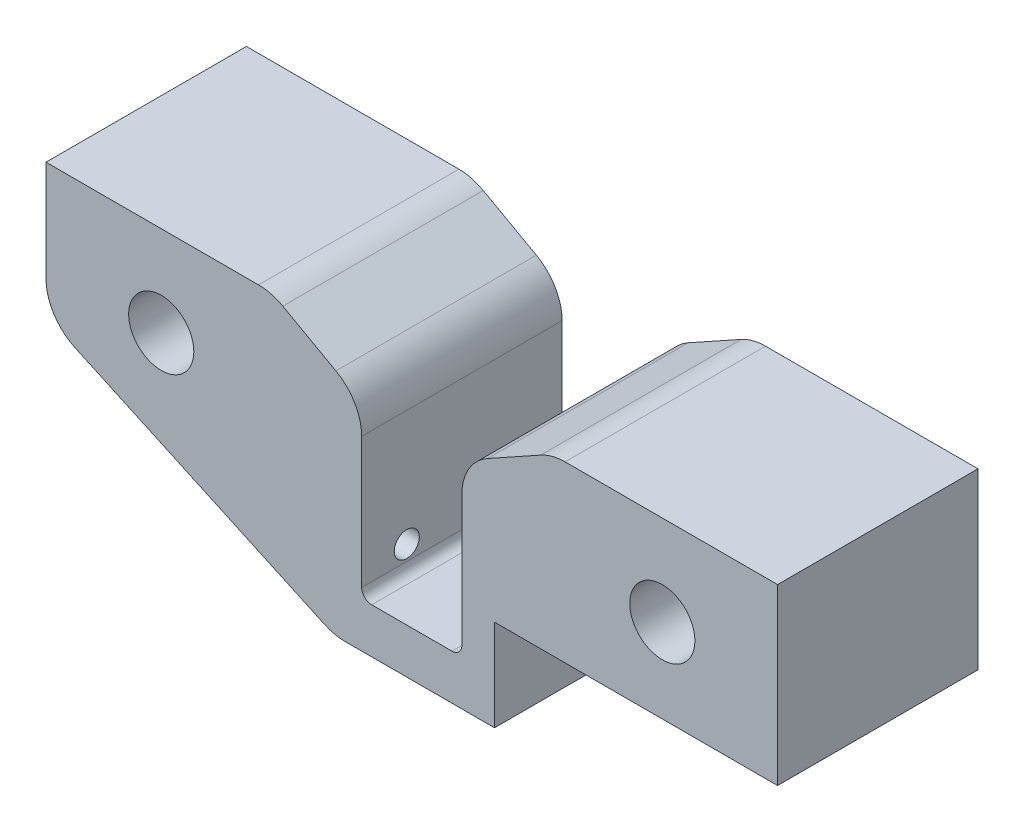
ISO-10303-21;
HEADER;
FILE_DESCRIPTION(('STEP AP214'),'2;1');
FILE_NAME('part.step','',(''),(''),'','','');
FILE_SCHEMA(('AUTOMOTIVE_DESIGN { 1 0 10303 214 1 1 1 1 }'));
ENDSEC;
DATA;
#1=APPLICATION_CONTEXT('core data for automotive mechanical design processes');
#2=APPLICATION_PROTOCOL_DEFINITION('international standard','automotive_design',2000,#1);
#3=PRODUCT_CONTEXT('',#1,'mechanical');
#4=PRODUCT('Part','Part','',(#3));
#5=PRODUCT_RELATED_PRODUCT_CATEGORY('part','',(#4));
#6=PRODUCT_DEFINITION_FORMATION('','',#4);
#7=PRODUCT_DEFINITION_CONTEXT('part definition',#1,'design');
#8=PRODUCT_DEFINITION('design','',#6,#7);
#9=PRODUCT_DEFINITION_SHAPE('','',#8);
#10=(LENGTH_UNIT() NAMED_UNIT(*) SI_UNIT(.MILLI.,.METRE.));
#11=(NAMED_UNIT(*) PLANE_ANGLE_UNIT() SI_UNIT($,.RADIAN.));
#12=(NAMED_UNIT(*) SI_UNIT($,.STERADIAN.) SOLID_ANGLE_UNIT());
#13=UNCERTAINTY_MEASURE_WITH_UNIT(LENGTH_MEASURE(1.E-05),#10,'distance_accuracy_value','');
#14=(GEOMETRIC_REPRESENTATION_CONTEXT(3) GLOBAL_UNCERTAINTY_ASSIGNED_CONTEXT((#13)) GLOBAL_UNIT_ASSIGNED_CONTEXT((#10,
#11,#12)) REPRESENTATION_CONTEXT('',''));
#15=CARTESIAN_POINT('',(0.,0.,0.));
#16=DIRECTION('',(0.,0.,1.));
#17=DIRECTION('',(1.,0.,0.));
#18=AXIS2_PLACEMENT_3D('',#15,#16,#17);
#19=CARTESIAN_POINT('',(0.,0.,25.4));
#20=DIRECTION('',(0.,0.,1.));
#21=DIRECTION('',(1.,0.,0.));
#22=AXIS2_PLACEMENT_3D('',#19,#20,#21);
#23=PLANE('',#22);
#24=DIRECTION('',(0.908325815942853,-0.418263328648053,0.));
#25=VECTOR('',#24,1.);
#26=CARTESIAN_POINT('',(-9.81138830642081,0.,25.4));
#27=LINE('',#26,#25);
#28=CARTESIAN_POINT('',(-42.6609721369151,15.1264843919291,25.4));
#29=VERTEX_POINT('',#28);
#30=CARTESIAN_POINT('',(-11.0755791685001,0.582131068762884,25.4));
#31=VERTEX_POINT('',#30);
#32=EDGE_CURVE('E268',#29,#31,#27,.T.);
#33=ORIENTED_EDGE('',*,*,#32,.T.);
#34=CARTESIAN_POINT('',(-8.41960703158495,6.35,25.4));
#35=DIRECTION('',(0.,0.,1.));
#36=DIRECTION('',(1.,0.,0.));
#37=AXIS2_PLACEMENT_3D('',#34,#35,#36);
#38=CIRCLE('',#37,6.35);
#39=CARTESIAN_POINT('',(-8.41960703158497,0.,25.4));
#40=VERTEX_POINT('',#39);
#41=EDGE_CURVE('E45',#31,#40,#38,.T.);
#42=ORIENTED_EDGE('',*,*,#41,.T.);
#43=DIRECTION('',(1.,0.,0.));
#44=VECTOR('',#43,1.);
#45=CARTESIAN_POINT('',(-46.355,0.,25.4));
#46=LINE('',#45,#44);
#47=CARTESIAN_POINT('',(10.4825314737521,0.,25.4));
#48=VERTEX_POINT('',#47);
#49=EDGE_CURVE('E182',#40,#48,#46,.T.);
#50=ORIENTED_EDGE('',*,*,#49,.T.);
#51=DIRECTION('',(0.,1.,0.));
#52=VECTOR('',#51,1.);
#53=CARTESIAN_POINT('',(10.4825314737521,0.,25.4));
#54=LINE('',#53,#52);
#55=CARTESIAN_POINT('',(10.4825314737521,11.5964157249992,25.4));
#56=VERTEX_POINT('',#55);
#57=EDGE_CURVE('E186',#48,#56,#54,.T.);
#58=ORIENTED_EDGE('',*,*,#57,.T.);
#59=DIRECTION('',(1.,0.,0.));
#60=VECTOR('',#59,1.);
#61=CARTESIAN_POINT('',(10.4825314737521,11.5964157249992,25.4));
#62=LINE('',#61,#60);
#63=CARTESIAN_POINT('',(46.355,11.5964157249992,25.4));
#64=VERTEX_POINT('',#63);
#65=EDGE_CURVE('E203',#56,#64,#62,.T.);
#66=ORIENTED_EDGE('',*,*,#65,.T.);
#67=DIRECTION('',(0.,1.,0.));
#68=VECTOR('',#67,1.);
#69=CARTESIAN_POINT('',(46.355,0.,25.4));
#70=LINE('',#69,#68);
#71=CARTESIAN_POINT('',(46.355,33.655,25.4));
#72=VERTEX_POINT('',#71);
#73=EDGE_CURVE('E192',#64,#72,#70,.T.);
#74=ORIENTED_EDGE('',*,*,#73,.T.);
#75=DIRECTION('',(-1.,0.,0.));
#76=VECTOR('',#75,1.);
#77=CARTESIAN_POINT('',(46.355,33.655,25.4));
#78=LINE('',#77,#76);
#79=CARTESIAN_POINT('',(19.4254502790535,33.655,25.4));
#80=VERTEX_POINT('',#79);
#81=EDGE_CURVE('E236',#72,#80,#78,.T.);
#82=ORIENTED_EDGE('',*,*,#81,.T.);
#83=CARTESIAN_POINT('',(19.4254502790535,27.305,25.4));
#84=DIRECTION('',(0.,0.,1.));
#85=DIRECTION('',(1.,0.,0.));
#86=AXIS2_PLACEMENT_3D('',#83,#84,#85);
#87=CIRCLE('',#86,6.35);
#88=CARTESIAN_POINT('',(16.3416176660692,32.8558987033718,25.4));
#89=VERTEX_POINT('',#88);
#90=EDGE_CURVE('E378',#80,#89,#87,.T.);
#91=ORIENTED_EDGE('',*,*,#90,.T.);
#92=DIRECTION('',(-0.874157276121537,-0.485642931178633,0.));
#93=VECTOR('',#92,1.);
#94=CARTESIAN_POINT('',(17.78,33.655,25.4));
#95=LINE('',#94,#93);
#96=CARTESIAN_POINT('',(9.61616738701568,29.1195374372309,25.4));
#97=VERTEX_POINT('',#96);
#98=EDGE_CURVE('E276',#89,#97,#95,.T.);
#99=ORIENTED_EDGE('',*,*,#98,.T.);
#100=CARTESIAN_POINT('',(12.7,23.5686387338592,25.4));
#101=DIRECTION('',(0.,0.,1.));
#102=DIRECTION('',(1.,0.,0.));
#103=AXIS2_PLACEMENT_3D('',#100,#101,#102);
#104=CIRCLE('',#103,6.35);
#105=CARTESIAN_POINT('',(6.34999999999999,23.5686387338592,25.4));
#106=VERTEX_POINT('',#105);
#107=EDGE_CURVE('E380',#97,#106,#104,.T.);
#108=ORIENTED_EDGE('',*,*,#107,.T.);
#109=DIRECTION('',(0.,-1.,0.));
#110=VECTOR('',#109,1.);
#111=CARTESIAN_POINT('',(6.34999999999999,33.655,25.4));
#112=LINE('',#111,#110);
#113=CARTESIAN_POINT('',(6.35,6.985,25.4));
#114=VERTEX_POINT('',#113);
#115=EDGE_CURVE('E239',#106,#114,#112,.T.);
#116=ORIENTED_EDGE('',*,*,#115,.T.);
#117=CARTESIAN_POINT('',(5.08,6.985,25.4));
#118=DIRECTION('',(0.,0.,1.));
#119=DIRECTION('',(1.,0.,0.));
#120=AXIS2_PLACEMENT_3D('',#117,#118,#119);
#121=CIRCLE('',#120,1.27);
#122=CARTESIAN_POINT('',(5.08,5.715,25.4));
#123=VERTEX_POINT('',#122);
#124=EDGE_CURVE('E360',#114,#123,#121,.F.);
#125=ORIENTED_EDGE('',*,*,#124,.T.);
#126=DIRECTION('',(-1.,0.,0.));
#127=VECTOR('',#126,1.);
#128=CARTESIAN_POINT('',(6.35,5.715,25.4));
#129=LINE('',#128,#127);
#130=CARTESIAN_POINT('',(-5.08,5.71499999999999,25.4));
#131=VERTEX_POINT('',#130);
#132=EDGE_CURVE('E241',#123,#131,#129,.T.);
#133=ORIENTED_EDGE('',*,*,#132,.T.);
#134=CARTESIAN_POINT('',(-5.08,6.98499999999999,25.4));
#135=DIRECTION('',(0.,0.,1.));
#136=DIRECTION('',(1.,0.,0.));
#137=AXIS2_PLACEMENT_3D('',#134,#135,#136);
#138=CIRCLE('',#137,1.27);
#139=CARTESIAN_POINT('',(-6.35,6.98499999999999,25.4));
#140=VERTEX_POINT('',#139);
#141=EDGE_CURVE('E355',#131,#140,#138,.F.);
#142=ORIENTED_EDGE('',*,*,#141,.T.);
#143=DIRECTION('',(0.,1.,0.));
#144=VECTOR('',#143,1.);
#145=CARTESIAN_POINT('',(-6.35,5.71499999999999,25.4));
#146=LINE('',#145,#144);
#147=CARTESIAN_POINT('',(-6.35,23.5686387338592,25.4));
#148=VERTEX_POINT('',#147);
#149=EDGE_CURVE('E244',#140,#148,#146,.T.);
#150=ORIENTED_EDGE('',*,*,#149,.T.);
#151=CARTESIAN_POINT('',(-12.7,23.5686387338592,25.4));
#152=DIRECTION('',(0.,0.,1.));
#153=DIRECTION('',(1.,0.,0.));
#154=AXIS2_PLACEMENT_3D('',#151,#152,#153);
#155=CIRCLE('',#154,6.35);
#156=CARTESIAN_POINT('',(-9.61616738701568,29.1195374372309,25.4));
#157=VERTEX_POINT('',#156);
#158=EDGE_CURVE('E382',#148,#157,#155,.T.);
#159=ORIENTED_EDGE('',*,*,#158,.T.);
#160=DIRECTION('',(-0.874157276121537,0.485642931178633,0.));
#161=VECTOR('',#160,1.);
#162=CARTESIAN_POINT('',(-17.78,33.655,25.4));
#163=LINE('',#162,#161);
#164=CARTESIAN_POINT('',(-16.3416176660691,32.8558987033718,25.4));
#165=VERTEX_POINT('',#164);
#166=EDGE_CURVE('E280',#157,#165,#163,.T.);
#167=ORIENTED_EDGE('',*,*,#166,.T.);
#168=CARTESIAN_POINT('',(-19.4254502790535,27.305,25.4));
#169=DIRECTION('',(0.,0.,1.));
#170=DIRECTION('',(1.,0.,0.));
#171=AXIS2_PLACEMENT_3D('',#168,#169,#170);
#172=CIRCLE('',#171,6.35);
#173=CARTESIAN_POINT('',(-19.4254502790535,33.655,25.4));
#174=VERTEX_POINT('',#173);
#175=EDGE_CURVE('E384',#165,#174,#172,.T.);
#176=ORIENTED_EDGE('',*,*,#175,.T.);
#177=DIRECTION('',(-1.,0.,0.));
#178=VECTOR('',#177,1.);
#179=CARTESIAN_POINT('',(-6.35,33.655,25.4));
#180=LINE('',#179,#178);
#181=CARTESIAN_POINT('',(-46.355,33.655,25.4));
#182=VERTEX_POINT('',#181);
#183=EDGE_CURVE('E247',#174,#182,#180,.T.);
#184=ORIENTED_EDGE('',*,*,#183,.T.);
#185=DIRECTION('',(0.,-1.,0.));
#186=VECTOR('',#185,1.);
#187=CARTESIAN_POINT('',(-46.355,33.655,25.4));
#188=LINE('',#187,#186);
#189=CARTESIAN_POINT('',(-46.355,20.8943533231662,25.4));
#190=VERTEX_POINT('',#189);
#191=EDGE_CURVE('E193',#182,#190,#188,.T.);
#192=ORIENTED_EDGE('',*,*,#191,.T.);
#193=CARTESIAN_POINT('',(-40.005,20.8943533231662,25.4));
#194=DIRECTION('',(0.,0.,1.));
#195=DIRECTION('',(1.,0.,0.));
#196=AXIS2_PLACEMENT_3D('',#193,#194,#195);
#197=CIRCLE('',#196,6.35);
#198=EDGE_CURVE('E453',#190,#29,#197,.T.);
#199=ORIENTED_EDGE('',*,*,#198,.T.);
#200=EDGE_LOOP('',(#33,#42,#50,#58,#66,#74,#82,#91,#99,#108,#116,#125,#133,#142,#150,#159,#167,
#176,#184,#192,#199));
#201=FACE_BOUND('',#200,.T.);
#202=CARTESIAN_POINT('',(-31.75,22.225,25.4));
#203=DIRECTION('',(0.,0.,1.));
#204=DIRECTION('',(1.,0.,0.));
#205=AXIS2_PLACEMENT_3D('',#202,#203,#204);
#206=CIRCLE('',#205,4.1275);
#207=CARTESIAN_POINT('',(-27.6225,22.225,25.4));
#208=VERTEX_POINT('',#207);
#209=EDGE_CURVE('E227',#208,#208,#206,.T.);
#210=ORIENTED_EDGE('',*,*,#209,.F.);
#211=EDGE_LOOP('',(#210));
#212=FACE_BOUND('',#211,.T.);
#213=CARTESIAN_POINT('',(31.75,22.225,25.4));
#214=DIRECTION('',(0.,0.,1.));
#215=DIRECTION('',(1.,0.,0.));
#216=AXIS2_PLACEMENT_3D('',#213,#214,#215);
#217=CIRCLE('',#216,4.1275);
#218=CARTESIAN_POINT('',(35.8775,22.225,25.4));
#219=VERTEX_POINT('',#218);
#220=EDGE_CURVE('E221',#219,#219,#217,.T.);
#221=ORIENTED_EDGE('',*,*,#220,.F.);
#222=EDGE_LOOP('',(#221));
#223=FACE_BOUND('',#222,.T.);
#224=ADVANCED_FACE('F37',(#201,#212,#223),#23,.T.);
#225=CARTESIAN_POINT('',(0.,0.,0.));
#226=DIRECTION('',(0.,0.,1.));
#227=DIRECTION('',(1.,0.,0.));
#228=AXIS2_PLACEMENT_3D('',#225,#226,#227);
#229=PLANE('',#228);
#230=DIRECTION('',(1.,0.,0.));
#231=VECTOR('',#230,1.);
#232=CARTESIAN_POINT('',(-46.355,0.,0.));
#233=LINE('',#232,#231);
#234=CARTESIAN_POINT('',(-8.41960703158497,0.,0.));
#235=VERTEX_POINT('',#234);
#236=CARTESIAN_POINT('',(10.4825314737521,0.,0.));
#237=VERTEX_POINT('',#236);
#238=EDGE_CURVE('E208',#235,#237,#233,.T.);
#239=ORIENTED_EDGE('',*,*,#238,.F.);
#240=CARTESIAN_POINT('',(-8.41960703158495,6.35,0.));
#241=DIRECTION('',(0.,0.,1.));
#242=DIRECTION('',(1.,0.,0.));
#243=AXIS2_PLACEMENT_3D('',#240,#241,#242);
#244=CIRCLE('',#243,6.35);
#245=CARTESIAN_POINT('',(-11.0755791685001,0.582131068762884,0.));
#246=VERTEX_POINT('',#245);
#247=EDGE_CURVE('E461',#235,#246,#244,.F.);
#248=ORIENTED_EDGE('',*,*,#247,.T.);
#249=DIRECTION('',(-0.908325815942853,0.418263328648053,0.));
#250=VECTOR('',#249,1.);
#251=CARTESIAN_POINT('',(-1.71644559679299,-3.72753655518389,0.));
#252=LINE('',#251,#250);
#253=CARTESIAN_POINT('',(-42.6609721369151,15.1264843919291,0.));
#254=VERTEX_POINT('',#253);
#255=EDGE_CURVE('E263',#246,#254,#252,.T.);
#256=ORIENTED_EDGE('',*,*,#255,.T.);
#257=CARTESIAN_POINT('',(-40.005,20.8943533231662,0.));
#258=DIRECTION('',(0.,0.,1.));
#259=DIRECTION('',(1.,0.,0.));
#260=AXIS2_PLACEMENT_3D('',#257,#258,#259);
#261=CIRCLE('',#260,6.35);
#262=CARTESIAN_POINT('',(-46.355,20.8943533231662,0.));
#263=VERTEX_POINT('',#262);
#264=EDGE_CURVE('E262',#254,#263,#261,.F.);
#265=ORIENTED_EDGE('',*,*,#264,.T.);
#266=DIRECTION('',(0.,-1.,0.));
#267=VECTOR('',#266,1.);
#268=CARTESIAN_POINT('',(-46.355,33.655,0.));
#269=LINE('',#268,#267);
#270=CARTESIAN_POINT('',(-46.355,33.655,0.));
#271=VERTEX_POINT('',#270);
#272=EDGE_CURVE('E230',#271,#263,#269,.T.);
#273=ORIENTED_EDGE('',*,*,#272,.F.);
#274=DIRECTION('',(-1.,0.,0.));
#275=VECTOR('',#274,1.);
#276=CARTESIAN_POINT('',(-6.35,33.655,0.));
#277=LINE('',#276,#275);
#278=CARTESIAN_POINT('',(-19.4254502790535,33.655,0.));
#279=VERTEX_POINT('',#278);
#280=EDGE_CURVE('E233',#279,#271,#277,.T.);
#281=ORIENTED_EDGE('',*,*,#280,.F.);
#282=CARTESIAN_POINT('',(-19.4254502790535,27.305,0.));
#283=DIRECTION('',(0.,0.,1.));
#284=DIRECTION('',(1.,0.,0.));
#285=AXIS2_PLACEMENT_3D('',#282,#283,#284);
#286=CIRCLE('',#285,6.35);
#287=CARTESIAN_POINT('',(-16.3416176660691,32.8558987033718,0.));
#288=VERTEX_POINT('',#287);
#289=EDGE_CURVE('E371',#279,#288,#286,.F.);
#290=ORIENTED_EDGE('',*,*,#289,.T.);
#291=DIRECTION('',(0.874157276121537,-0.485642931178633,0.));
#292=VECTOR('',#291,1.);
#293=CARTESIAN_POINT('',(10.0941037735849,18.1693867924528,0.));
#294=LINE('',#293,#292);
#295=CARTESIAN_POINT('',(-9.61616738701568,29.1195374372309,0.));
#296=VERTEX_POINT('',#295);
#297=EDGE_CURVE('E279',#288,#296,#294,.T.);
#298=ORIENTED_EDGE('',*,*,#297,.T.);
#299=CARTESIAN_POINT('',(-12.7,23.5686387338592,0.));
#300=DIRECTION('',(0.,0.,1.));
#301=DIRECTION('',(1.,0.,0.));
#302=AXIS2_PLACEMENT_3D('',#299,#300,#301);
#303=CIRCLE('',#302,6.35);
#304=CARTESIAN_POINT('',(-6.35,23.5686387338592,0.));
#305=VERTEX_POINT('',#304);
#306=EDGE_CURVE('E369',#296,#305,#303,.F.);
#307=ORIENTED_EDGE('',*,*,#306,.T.);
#308=DIRECTION('',(0.,1.,0.));
#309=VECTOR('',#308,1.);
#310=CARTESIAN_POINT('',(-6.35,5.71499999999999,0.));
#311=LINE('',#310,#309);
#312=CARTESIAN_POINT('',(-6.35,6.98499999999999,0.));
#313=VERTEX_POINT('',#312);
#314=EDGE_CURVE('E332',#313,#305,#311,.T.);
#315=ORIENTED_EDGE('',*,*,#314,.F.);
#316=CARTESIAN_POINT('',(-5.08,6.98499999999999,0.));
#317=DIRECTION('',(0.,0.,1.));
#318=DIRECTION('',(1.,0.,0.));
#319=AXIS2_PLACEMENT_3D('',#316,#317,#318);
#320=CIRCLE('',#319,1.27);
#321=CARTESIAN_POINT('',(-5.08,5.71499999999999,0.));
#322=VERTEX_POINT('',#321);
#323=EDGE_CURVE('E353',#313,#322,#320,.T.);
#324=ORIENTED_EDGE('',*,*,#323,.T.);
#325=DIRECTION('',(-1.,0.,0.));
#326=VECTOR('',#325,1.);
#327=CARTESIAN_POINT('',(6.35,5.715,0.));
#328=LINE('',#327,#326);
#329=CARTESIAN_POINT('',(5.08,5.715,0.));
#330=VERTEX_POINT('',#329);
#331=EDGE_CURVE('E327',#330,#322,#328,.T.);
#332=ORIENTED_EDGE('',*,*,#331,.F.);
#333=CARTESIAN_POINT('',(5.08,6.985,0.));
#334=DIRECTION('',(0.,0.,1.));
#335=DIRECTION('',(1.,0.,0.));
#336=AXIS2_PLACEMENT_3D('',#333,#334,#335);
#337=CIRCLE('',#336,1.27);
#338=CARTESIAN_POINT('',(6.35,6.985,0.));
#339=VERTEX_POINT('',#338);
#340=EDGE_CURVE('E357',#330,#339,#337,.T.);
#341=ORIENTED_EDGE('',*,*,#340,.T.);
#342=DIRECTION('',(0.,-1.,0.));
#343=VECTOR('',#342,1.);
#344=CARTESIAN_POINT('',(6.34999999999999,33.655,0.));
#345=LINE('',#344,#343);
#346=CARTESIAN_POINT('',(6.34999999999999,23.5686387338592,0.));
#347=VERTEX_POINT('',#346);
#348=EDGE_CURVE('E324',#347,#339,#345,.T.);
#349=ORIENTED_EDGE('',*,*,#348,.F.);
#350=CARTESIAN_POINT('',(12.7,23.5686387338592,0.));
#351=DIRECTION('',(0.,0.,1.));
#352=DIRECTION('',(1.,0.,0.));
#353=AXIS2_PLACEMENT_3D('',#350,#351,#352);
#354=CIRCLE('',#353,6.35);
#355=CARTESIAN_POINT('',(9.61616738701568,29.1195374372309,0.));
#356=VERTEX_POINT('',#355);
#357=EDGE_CURVE('E367',#347,#356,#354,.F.);
#358=ORIENTED_EDGE('',*,*,#357,.T.);
#359=DIRECTION('',(0.874157276121537,0.485642931178633,0.));
#360=VECTOR('',#359,1.);
#361=CARTESIAN_POINT('',(-10.0941037735849,18.1693867924528,0.));
#362=LINE('',#361,#360);
#363=CARTESIAN_POINT('',(16.3416176660692,32.8558987033718,0.));
#364=VERTEX_POINT('',#363);
#365=EDGE_CURVE('E285',#356,#364,#362,.T.);
#366=ORIENTED_EDGE('',*,*,#365,.T.);
#367=CARTESIAN_POINT('',(19.4254502790535,27.305,0.));
#368=DIRECTION('',(0.,0.,1.));
#369=DIRECTION('',(1.,0.,0.));
#370=AXIS2_PLACEMENT_3D('',#367,#368,#369);
#371=CIRCLE('',#370,6.35);
#372=CARTESIAN_POINT('',(19.4254502790535,33.655,0.));
#373=VERTEX_POINT('',#372);
#374=EDGE_CURVE('E365',#364,#373,#371,.F.);
#375=ORIENTED_EDGE('',*,*,#374,.T.);
#376=DIRECTION('',(-1.,0.,0.));
#377=VECTOR('',#376,1.);
#378=CARTESIAN_POINT('',(46.355,33.655,0.));
#379=LINE('',#378,#377);
#380=CARTESIAN_POINT('',(46.355,33.655,0.));
#381=VERTEX_POINT('',#380);
#382=EDGE_CURVE('E323',#381,#373,#379,.T.);
#383=ORIENTED_EDGE('',*,*,#382,.F.);
#384=DIRECTION('',(0.,1.,0.));
#385=VECTOR('',#384,1.);
#386=CARTESIAN_POINT('',(46.355,0.,0.));
#387=LINE('',#386,#385);
#388=CARTESIAN_POINT('',(46.355,11.5964157249992,0.));
#389=VERTEX_POINT('',#388);
#390=EDGE_CURVE('E253',#389,#381,#387,.T.);
#391=ORIENTED_EDGE('',*,*,#390,.F.);
#392=DIRECTION('',(-1.,0.,0.));
#393=VECTOR('',#392,1.);
#394=CARTESIAN_POINT('',(0.,11.5964157249992,0.));
#395=LINE('',#394,#393);
#396=CARTESIAN_POINT('',(10.4825314737521,11.5964157249992,0.));
#397=VERTEX_POINT('',#396);
#398=EDGE_CURVE('E215',#389,#397,#395,.T.);
#399=ORIENTED_EDGE('',*,*,#398,.T.);
#400=DIRECTION('',(0.,-1.,0.));
#401=VECTOR('',#400,1.);
#402=CARTESIAN_POINT('',(10.4825314737521,0.,0.));
#403=LINE('',#402,#401);
#404=EDGE_CURVE('E218',#397,#237,#403,.T.);
#405=ORIENTED_EDGE('',*,*,#404,.T.);
#406=EDGE_LOOP('',(#239,#248,#256,#265,#273,#281,#290,#298,#307,#315,#324,#332,#341,#349,#358,
#366,#375,#383,#391,#399,#405));
#407=FACE_BOUND('',#406,.T.);
#408=CARTESIAN_POINT('',(-31.75,22.225,0.));
#409=DIRECTION('',(0.,0.,1.));
#410=DIRECTION('',(1.,0.,0.));
#411=AXIS2_PLACEMENT_3D('',#408,#409,#410);
#412=CIRCLE('',#411,4.1275);
#413=CARTESIAN_POINT('',(-27.6225,22.225,0.));
#414=VERTEX_POINT('',#413);
#415=EDGE_CURVE('E224',#414,#414,#412,.T.);
#416=ORIENTED_EDGE('',*,*,#415,.T.);
#417=EDGE_LOOP('',(#416));
#418=FACE_BOUND('',#417,.T.);
#419=CARTESIAN_POINT('',(31.75,22.225,0.));
#420=DIRECTION('',(0.,0.,1.));
#421=DIRECTION('',(1.,0.,0.));
#422=AXIS2_PLACEMENT_3D('',#419,#420,#421);
#423=CIRCLE('',#422,4.1275);
#424=CARTESIAN_POINT('',(35.8775,22.225,0.));
#425=VERTEX_POINT('',#424);
#426=EDGE_CURVE('E220',#425,#425,#423,.T.);
#427=ORIENTED_EDGE('',*,*,#426,.T.);
#428=EDGE_LOOP('',(#427));
#429=FACE_BOUND('',#428,.T.);
#430=ADVANCED_FACE('F320',(#407,#418,#429),#229,.F.);
#431=CARTESIAN_POINT('',(-46.355,33.655,25.4));
#432=DIRECTION('',(1.,0.,0.));
#433=DIRECTION('',(0.,1.,0.));
#434=AXIS2_PLACEMENT_3D('',#431,#432,#433);
#435=PLANE('',#434);
#436=ORIENTED_EDGE('',*,*,#272,.T.);
#437=DIRECTION('',(0.,0.,-1.));
#438=VECTOR('',#437,1.);
#439=CARTESIAN_POINT('',(-46.355,20.8943533231662,25.4));
#440=LINE('',#439,#438);
#441=EDGE_CURVE('E11',#263,#190,#440,.F.);
#442=ORIENTED_EDGE('',*,*,#441,.T.);
#443=ORIENTED_EDGE('',*,*,#191,.F.);
#444=DIRECTION('',(0.,0.,-1.));
#445=VECTOR('',#444,1.);
#446=CARTESIAN_POINT('',(-46.355,33.655,25.4));
#447=LINE('',#446,#445);
#448=EDGE_CURVE('E249',#182,#271,#447,.T.);
#449=ORIENTED_EDGE('',*,*,#448,.T.);
#450=EDGE_LOOP('',(#436,#442,#443,#449));
#451=FACE_BOUND('',#450,.T.);
#452=ADVANCED_FACE('F451',(#451),#435,.F.);
#453=CARTESIAN_POINT('',(-46.355,0.,25.4));
#454=DIRECTION('',(0.,1.,0.));
#455=DIRECTION('',(-1.,0.,0.));
#456=AXIS2_PLACEMENT_3D('',#453,#454,#455);
#457=PLANE('',#456);
#458=CARTESIAN_POINT('',(0.,0.,12.7));
#459=DIRECTION('',(0.,-1.,0.));
#460=DIRECTION('',(1.,0.,0.));
#461=AXIS2_PLACEMENT_3D('',#458,#459,#460);
#462=CIRCLE('',#461,2.286);
#463=CARTESIAN_POINT('',(2.286,0.,12.7));
#464=VERTEX_POINT('',#463);
#465=EDGE_CURVE('E267',#464,#464,#462,.T.);
#466=ORIENTED_EDGE('',*,*,#465,.F.);
#467=EDGE_LOOP('',(#466));
#468=FACE_BOUND('',#467,.T.);
#469=ORIENTED_EDGE('',*,*,#49,.F.);
#470=DIRECTION('',(0.,0.,-1.));
#471=VECTOR('',#470,1.);
#472=CARTESIAN_POINT('',(-8.41960703158495,0.,25.4));
#473=LINE('',#472,#471);
#474=EDGE_CURVE('E260',#40,#235,#473,.T.);
#475=ORIENTED_EDGE('',*,*,#474,.T.);
#476=ORIENTED_EDGE('',*,*,#238,.T.);
#477=DIRECTION('',(0.,0.,-1.));
#478=VECTOR('',#477,1.);
#479=CARTESIAN_POINT('',(10.4825314737521,0.,25.4));
#480=LINE('',#479,#478);
#481=EDGE_CURVE('E198',#48,#237,#480,.T.);
#482=ORIENTED_EDGE('',*,*,#481,.F.);
#483=EDGE_LOOP('',(#469,#475,#476,#482));
#484=FACE_BOUND('',#483,.T.);
#485=ADVANCED_FACE('F206',(#468,#484),#457,.F.);
#486=CARTESIAN_POINT('',(46.355,0.,25.4));
#487=DIRECTION('',(-1.,0.,0.));
#488=DIRECTION('',(0.,-1.,0.));
#489=AXIS2_PLACEMENT_3D('',#486,#487,#488);
#490=PLANE('',#489);
#491=ORIENTED_EDGE('',*,*,#73,.F.);
#492=DIRECTION('',(0.,0.,-1.));
#493=VECTOR('',#492,1.);
#494=CARTESIAN_POINT('',(46.355,11.5964157249992,25.4));
#495=LINE('',#494,#493);
#496=EDGE_CURVE('E210',#64,#389,#495,.T.);
#497=ORIENTED_EDGE('',*,*,#496,.T.);
#498=ORIENTED_EDGE('',*,*,#390,.T.);
#499=DIRECTION('',(0.,0.,-1.));
#500=VECTOR('',#499,1.);
#501=CARTESIAN_POINT('',(46.355,33.655,25.4));
#502=LINE('',#501,#500);
#503=EDGE_CURVE('E338',#72,#381,#502,.T.);
#504=ORIENTED_EDGE('',*,*,#503,.F.);
#505=EDGE_LOOP('',(#491,#497,#498,#504));
#506=FACE_BOUND('',#505,.T.);
#507=ADVANCED_FACE('F314',(#506),#490,.F.);
#508=CARTESIAN_POINT('',(46.355,33.655,25.4));
#509=DIRECTION('',(0.,-1.,0.));
#510=DIRECTION('',(1.,0.,0.));
#511=AXIS2_PLACEMENT_3D('',#508,#509,#510);
#512=PLANE('',#511);
#513=ORIENTED_EDGE('',*,*,#382,.T.);
#514=DIRECTION('',(0.,0.,-1.));
#515=VECTOR('',#514,1.);
#516=CARTESIAN_POINT('',(19.4254502790535,33.655,25.4));
#517=LINE('',#516,#515);
#518=EDGE_CURVE('E258',#373,#80,#517,.F.);
#519=ORIENTED_EDGE('',*,*,#518,.T.);
#520=ORIENTED_EDGE('',*,*,#81,.F.);
#521=ORIENTED_EDGE('',*,*,#503,.T.);
#522=EDGE_LOOP('',(#513,#519,#520,#521));
#523=FACE_BOUND('',#522,.T.);
#524=ADVANCED_FACE('F399',(#523),#512,.F.);
#525=CARTESIAN_POINT('',(6.34999999999999,33.655,25.4));
#526=DIRECTION('',(1.,0.,0.));
#527=DIRECTION('',(0.,1.,0.));
#528=AXIS2_PLACEMENT_3D('',#525,#526,#527);
#529=PLANE('',#528);
#530=CARTESIAN_POINT('',(6.35,8.89,19.685));
#531=DIRECTION('',(1.,0.,0.));
#532=DIRECTION('',(0.,1.,0.));
#533=AXIS2_PLACEMENT_3D('',#530,#531,#532);
#534=CIRCLE('',#533,1.5875);
#535=CARTESIAN_POINT('',(6.35,10.4775,19.685));
#536=VERTEX_POINT('',#535);
#537=EDGE_CURVE('E204',#536,#536,#534,.T.);
#538=ORIENTED_EDGE('',*,*,#537,.T.);
#539=EDGE_LOOP('',(#538));
#540=FACE_BOUND('',#539,.T.);
#541=CARTESIAN_POINT('',(6.35,8.89,5.715));
#542=DIRECTION('',(1.,0.,0.));
#543=DIRECTION('',(0.,1.,0.));
#544=AXIS2_PLACEMENT_3D('',#541,#542,#543);
#545=CIRCLE('',#544,1.5875);
#546=CARTESIAN_POINT('',(6.35,10.4775,5.715));
#547=VERTEX_POINT('',#546);
#548=EDGE_CURVE('E303',#547,#547,#545,.T.);
#549=ORIENTED_EDGE('',*,*,#548,.T.);
#550=EDGE_LOOP('',(#549));
#551=FACE_BOUND('',#550,.T.);
#552=ORIENTED_EDGE('',*,*,#115,.F.);
#553=DIRECTION('',(0.,0.,-1.));
#554=VECTOR('',#553,1.);
#555=CARTESIAN_POINT('',(6.34999999999999,23.5686387338592,25.4));
#556=LINE('',#555,#554);
#557=EDGE_CURVE('E388',#106,#347,#556,.T.);
#558=ORIENTED_EDGE('',*,*,#557,.T.);
#559=ORIENTED_EDGE('',*,*,#348,.T.);
#560=DIRECTION('',(0.,0.,-1.));
#561=VECTOR('',#560,1.);
#562=CARTESIAN_POINT('',(6.35,6.985,25.4));
#563=LINE('',#562,#561);
#564=EDGE_CURVE('E350',#339,#114,#563,.F.);
#565=ORIENTED_EDGE('',*,*,#564,.T.);
#566=EDGE_LOOP('',(#552,#558,#559,#565));
#567=FACE_BOUND('',#566,.T.);
#568=ADVANCED_FACE('F412',(#540,#551,#567),#529,.F.);
#569=CARTESIAN_POINT('',(6.35,5.715,25.4));
#570=DIRECTION('',(0.,-1.,0.));
#571=DIRECTION('',(1.,0.,0.));
#572=AXIS2_PLACEMENT_3D('',#569,#570,#571);
#573=PLANE('',#572);
#574=CARTESIAN_POINT('',(0.,5.715,12.7));
#575=DIRECTION('',(0.,-1.,0.));
#576=DIRECTION('',(1.,0.,0.));
#577=AXIS2_PLACEMENT_3D('',#574,#575,#576);
#578=CIRCLE('',#577,2.286);
#579=CARTESIAN_POINT('',(2.286,5.715,12.7));
#580=VERTEX_POINT('',#579);
#581=EDGE_CURVE('E275',#580,#580,#578,.T.);
#582=ORIENTED_EDGE('',*,*,#581,.T.);
#583=EDGE_LOOP('',(#582));
#584=FACE_BOUND('',#583,.T.);
#585=ORIENTED_EDGE('',*,*,#331,.T.);
#586=DIRECTION('',(0.,0.,-1.));
#587=VECTOR('',#586,1.);
#588=CARTESIAN_POINT('',(-5.08,5.71499999999999,25.4));
#589=LINE('',#588,#587);
#590=EDGE_CURVE('E348',#322,#131,#589,.F.);
#591=ORIENTED_EDGE('',*,*,#590,.T.);
#592=ORIENTED_EDGE('',*,*,#132,.F.);
#593=DIRECTION('',(0.,0.,-1.));
#594=VECTOR('',#593,1.);
#595=CARTESIAN_POINT('',(5.08,5.715,0.));
#596=LINE('',#595,#594);
#597=EDGE_CURVE('E345',#123,#330,#596,.T.);
#598=ORIENTED_EDGE('',*,*,#597,.T.);
#599=EDGE_LOOP('',(#585,#591,#592,#598));
#600=FACE_BOUND('',#599,.T.);
#601=ADVANCED_FACE('F420',(#584,#600),#573,.F.);
#602=CARTESIAN_POINT('',(-6.35,5.71499999999999,25.4));
#603=DIRECTION('',(-1.,0.,0.));
#604=DIRECTION('',(0.,0.,1.));
#605=AXIS2_PLACEMENT_3D('',#602,#603,#604);
#606=PLANE('',#605);
#607=CARTESIAN_POINT('',(-6.35,8.89,19.685));
#608=DIRECTION('',(-1.,0.,0.));
#609=DIRECTION('',(0.,0.,1.));
#610=AXIS2_PLACEMENT_3D('',#607,#608,#609);
#611=CIRCLE('',#610,1.5875);
#612=CARTESIAN_POINT('',(-6.35,8.89,21.2725));
#613=VERTEX_POINT('',#612);
#614=EDGE_CURVE('E306',#613,#613,#611,.T.);
#615=ORIENTED_EDGE('',*,*,#614,.T.);
#616=EDGE_LOOP('',(#615));
#617=FACE_BOUND('',#616,.T.);
#618=CARTESIAN_POINT('',(-6.35,8.89,5.715));
#619=DIRECTION('',(-1.,0.,0.));
#620=DIRECTION('',(0.,0.,1.));
#621=AXIS2_PLACEMENT_3D('',#618,#619,#620);
#622=CIRCLE('',#621,1.5875);
#623=CARTESIAN_POINT('',(-6.35,8.89,7.3025));
#624=VERTEX_POINT('',#623);
#625=EDGE_CURVE('E292',#624,#624,#622,.T.);
#626=ORIENTED_EDGE('',*,*,#625,.T.);
#627=EDGE_LOOP('',(#626));
#628=FACE_BOUND('',#627,.T.);
#629=ORIENTED_EDGE('',*,*,#314,.T.);
#630=DIRECTION('',(0.,0.,-1.));
#631=VECTOR('',#630,1.);
#632=CARTESIAN_POINT('',(-6.35,23.5686387338592,25.4));
#633=LINE('',#632,#631);
#634=EDGE_CURVE('E386',#305,#148,#633,.F.);
#635=ORIENTED_EDGE('',*,*,#634,.T.);
#636=ORIENTED_EDGE('',*,*,#149,.F.);
#637=DIRECTION('',(0.,0.,-1.));
#638=VECTOR('',#637,1.);
#639=CARTESIAN_POINT('',(-6.35,6.98499999999999,0.));
#640=LINE('',#639,#638);
#641=EDGE_CURVE('E340',#140,#313,#640,.T.);
#642=ORIENTED_EDGE('',*,*,#641,.T.);
#643=EDGE_LOOP('',(#629,#635,#636,#642));
#644=FACE_BOUND('',#643,.T.);
#645=ADVANCED_FACE('F431',(#617,#628,#644),#606,.F.);
#646=CARTESIAN_POINT('',(-6.35,33.655,25.4));
#647=DIRECTION('',(0.,-1.,0.));
#648=DIRECTION('',(1.,0.,0.));
#649=AXIS2_PLACEMENT_3D('',#646,#647,#648);
#650=PLANE('',#649);
#651=ORIENTED_EDGE('',*,*,#183,.F.);
#652=DIRECTION('',(0.,0.,-1.));
#653=VECTOR('',#652,1.);
#654=CARTESIAN_POINT('',(-19.4254502790535,33.655,25.4));
#655=LINE('',#654,#653);
#656=EDGE_CURVE('E362',#174,#279,#655,.T.);
#657=ORIENTED_EDGE('',*,*,#656,.T.);
#658=ORIENTED_EDGE('',*,*,#280,.T.);
#659=ORIENTED_EDGE('',*,*,#448,.F.);
#660=EDGE_LOOP('',(#651,#657,#658,#659));
#661=FACE_BOUND('',#660,.T.);
#662=ADVANCED_FACE('F448',(#661),#650,.F.);
#663=CARTESIAN_POINT('',(-31.75,22.225,25.4));
#664=DIRECTION('',(0.,0.,-1.));
#665=DIRECTION('',(-1.,0.,0.));
#666=AXIS2_PLACEMENT_3D('',#663,#664,#665);
#667=CYLINDRICAL_SURFACE('',#666,4.1275);
#668=ORIENTED_EDGE('',*,*,#209,.T.);
#669=EDGE_LOOP('',(#668));
#670=FACE_BOUND('',#669,.T.);
#671=ORIENTED_EDGE('',*,*,#415,.F.);
#672=EDGE_LOOP('',(#671));
#673=FACE_BOUND('',#672,.T.);
#674=ADVANCED_FACE('F487',(#670,#673),#667,.F.);
#675=CARTESIAN_POINT('',(31.75,22.225,25.4));
#676=DIRECTION('',(0.,0.,-1.));
#677=DIRECTION('',(-1.,0.,0.));
#678=AXIS2_PLACEMENT_3D('',#675,#676,#677);
#679=CYLINDRICAL_SURFACE('',#678,4.1275);
#680=ORIENTED_EDGE('',*,*,#220,.T.);
#681=EDGE_LOOP('',(#680));
#682=FACE_BOUND('',#681,.T.);
#683=ORIENTED_EDGE('',*,*,#426,.F.);
#684=EDGE_LOOP('',(#683));
#685=FACE_BOUND('',#684,.T.);
#686=ADVANCED_FACE('F477',(#682,#685),#679,.F.);
#687=CARTESIAN_POINT('',(10.4825314737521,0.,25.4));
#688=DIRECTION('',(-1.,0.,0.));
#689=DIRECTION('',(0.,0.,1.));
#690=AXIS2_PLACEMENT_3D('',#687,#688,#689);
#691=PLANE('',#690);
#692=CARTESIAN_POINT('',(10.4825314737521,8.89,19.685));
#693=DIRECTION('',(1.,0.,0.));
#694=DIRECTION('',(0.,0.,-1.));
#695=AXIS2_PLACEMENT_3D('',#692,#693,#694);
#696=CIRCLE('',#695,1.5875);
#697=CARTESIAN_POINT('',(10.4825314737521,8.89,18.0975));
#698=VERTEX_POINT('',#697);
#699=EDGE_CURVE('E293',#698,#698,#696,.T.);
#700=ORIENTED_EDGE('',*,*,#699,.F.);
#701=EDGE_LOOP('',(#700));
#702=FACE_BOUND('',#701,.T.);
#703=CARTESIAN_POINT('',(10.4825314737521,8.89,5.715));
#704=DIRECTION('',(1.,0.,0.));
#705=DIRECTION('',(0.,0.,-1.));
#706=AXIS2_PLACEMENT_3D('',#703,#704,#705);
#707=CIRCLE('',#706,1.5875);
#708=CARTESIAN_POINT('',(10.4825314737521,8.89,4.1275));
#709=VERTEX_POINT('',#708);
#710=EDGE_CURVE('E288',#709,#709,#707,.T.);
#711=ORIENTED_EDGE('',*,*,#710,.F.);
#712=EDGE_LOOP('',(#711));
#713=FACE_BOUND('',#712,.T.);
#714=DIRECTION('',(0.,0.,-1.));
#715=VECTOR('',#714,1.);
#716=CARTESIAN_POINT('',(10.4825314737521,11.5964157249992,25.4));
#717=LINE('',#716,#715);
#718=EDGE_CURVE('E201',#56,#397,#717,.T.);
#719=ORIENTED_EDGE('',*,*,#718,.F.);
#720=ORIENTED_EDGE('',*,*,#57,.F.);
#721=ORIENTED_EDGE('',*,*,#481,.T.);
#722=ORIENTED_EDGE('',*,*,#404,.F.);
#723=EDGE_LOOP('',(#719,#720,#721,#722));
#724=FACE_BOUND('',#723,.T.);
#725=ADVANCED_FACE('F197',(#702,#713,#724),#691,.F.);
#726=CARTESIAN_POINT('',(10.4825314737521,11.5964157249992,25.4));
#727=DIRECTION('',(0.,1.,0.));
#728=DIRECTION('',(0.,0.,1.));
#729=AXIS2_PLACEMENT_3D('',#726,#727,#728);
#730=PLANE('',#729);
#731=ORIENTED_EDGE('',*,*,#496,.F.);
#732=ORIENTED_EDGE('',*,*,#65,.F.);
#733=ORIENTED_EDGE('',*,*,#718,.T.);
#734=ORIENTED_EDGE('',*,*,#398,.F.);
#735=EDGE_LOOP('',(#731,#732,#733,#734));
#736=FACE_BOUND('',#735,.T.);
#737=ADVANCED_FACE('F465',(#736),#730,.F.);
#738=CARTESIAN_POINT('',(-9.83746852624795,8.89,5.715));
#739=DIRECTION('',(1.,0.,0.));
#740=DIRECTION('',(0.,0.,-1.));
#741=AXIS2_PLACEMENT_3D('',#738,#739,#740);
#742=CYLINDRICAL_SURFACE('',#741,1.5875);
#743=ORIENTED_EDGE('',*,*,#710,.T.);
#744=EDGE_LOOP('',(#743));
#745=FACE_BOUND('',#744,.T.);
#746=ORIENTED_EDGE('',*,*,#548,.F.);
#747=EDGE_LOOP('',(#746));
#748=FACE_BOUND('',#747,.T.);
#749=ADVANCED_FACE('F467',(#745,#748),#742,.F.);
#750=CARTESIAN_POINT('',(-9.83746852624795,8.89,19.685));
#751=DIRECTION('',(1.,0.,0.));
#752=DIRECTION('',(0.,0.,-1.));
#753=AXIS2_PLACEMENT_3D('',#750,#751,#752);
#754=CYLINDRICAL_SURFACE('',#753,1.5875);
#755=ORIENTED_EDGE('',*,*,#699,.T.);
#756=EDGE_LOOP('',(#755));
#757=FACE_BOUND('',#756,.T.);
#758=ORIENTED_EDGE('',*,*,#537,.F.);
#759=EDGE_LOOP('',(#758));
#760=FACE_BOUND('',#759,.T.);
#761=ADVANCED_FACE('F473',(#757,#760),#754,.F.);
#762=CARTESIAN_POINT('',(-9.83746852624795,8.89,5.715));
#763=DIRECTION('',(1.,0.,0.));
#764=DIRECTION('',(0.,0.,-1.));
#765=AXIS2_PLACEMENT_3D('',#762,#763,#764);
#766=CIRCLE('',#765,1.5875);
#767=CARTESIAN_POINT('',(-9.83746852624795,8.89,4.1275));
#768=VERTEX_POINT('',#767);
#769=EDGE_CURVE('E296',#768,#768,#766,.T.);
#770=ORIENTED_EDGE('',*,*,#769,.F.);
#771=EDGE_LOOP('',(#770));
#772=FACE_BOUND('',#771,.T.);
#773=ORIENTED_EDGE('',*,*,#625,.F.);
#774=EDGE_LOOP('',(#773));
#775=FACE_BOUND('',#774,.T.);
#776=ADVANCED_FACE('F476',(#772,#775),#742,.F.);
#777=CARTESIAN_POINT('',(-9.83746852624795,8.89,5.715));
#778=DIRECTION('',(1.,0.,0.));
#779=DIRECTION('',(0.,0.,-1.));
#780=AXIS2_PLACEMENT_3D('',#777,#778,#779);
#781=PLANE('',#780);
#782=ORIENTED_EDGE('',*,*,#769,.T.);
#783=EDGE_LOOP('',(#782));
#784=FACE_BOUND('',#783,.T.);
#785=ADVANCED_FACE('F676',(#784),#781,.T.);
#786=CARTESIAN_POINT('',(-9.83746852624795,8.89,19.685));
#787=DIRECTION('',(1.,0.,0.));
#788=DIRECTION('',(0.,0.,-1.));
#789=AXIS2_PLACEMENT_3D('',#786,#787,#788);
#790=CIRCLE('',#789,1.5875);
#791=CARTESIAN_POINT('',(-9.83746852624795,8.89,18.0975));
#792=VERTEX_POINT('',#791);
#793=EDGE_CURVE('E289',#792,#792,#790,.T.);
#794=ORIENTED_EDGE('',*,*,#793,.F.);
#795=EDGE_LOOP('',(#794));
#796=FACE_BOUND('',#795,.T.);
#797=ORIENTED_EDGE('',*,*,#614,.F.);
#798=EDGE_LOOP('',(#797));
#799=FACE_BOUND('',#798,.T.);
#800=ADVANCED_FACE('F666',(#796,#799),#754,.F.);
#801=CARTESIAN_POINT('',(-9.83746852624795,8.89,19.685));
#802=DIRECTION('',(1.,0.,0.));
#803=DIRECTION('',(0.,0.,-1.));
#804=AXIS2_PLACEMENT_3D('',#801,#802,#803);
#805=PLANE('',#804);
#806=ORIENTED_EDGE('',*,*,#793,.T.);
#807=EDGE_LOOP('',(#806));
#808=FACE_BOUND('',#807,.T.);
#809=ADVANCED_FACE('F608',(#808),#805,.T.);
#810=CARTESIAN_POINT('',(-17.78,33.655,25.4));
#811=DIRECTION('',(-0.485642931178633,-0.874157276121537,0.));
#812=DIRECTION('',(0.874157276121537,-0.485642931178633,0.));
#813=AXIS2_PLACEMENT_3D('',#810,#811,#812);
#814=PLANE('',#813);
#815=ORIENTED_EDGE('',*,*,#297,.F.);
#816=DIRECTION('',(0.,0.,-1.));
#817=VECTOR('',#816,1.);
#818=CARTESIAN_POINT('',(-16.3416176660691,32.8558987033718,25.4));
#819=LINE('',#818,#817);
#820=EDGE_CURVE('E376',#288,#165,#819,.F.);
#821=ORIENTED_EDGE('',*,*,#820,.T.);
#822=ORIENTED_EDGE('',*,*,#166,.F.);
#823=DIRECTION('',(0.,0.,-1.));
#824=VECTOR('',#823,1.);
#825=CARTESIAN_POINT('',(-9.61616738701568,29.1195374372309,25.4));
#826=LINE('',#825,#824);
#827=EDGE_CURVE('E373',#157,#296,#826,.T.);
#828=ORIENTED_EDGE('',*,*,#827,.T.);
#829=EDGE_LOOP('',(#815,#821,#822,#828));
#830=FACE_BOUND('',#829,.T.);
#831=ADVANCED_FACE('F440',(#830),#814,.F.);
#832=CARTESIAN_POINT('',(17.78,33.655,25.4));
#833=DIRECTION('',(0.485642931178633,-0.874157276121537,0.));
#834=DIRECTION('',(0.874157276121537,0.485642931178633,0.));
#835=AXIS2_PLACEMENT_3D('',#832,#833,#834);
#836=PLANE('',#835);
#837=ORIENTED_EDGE('',*,*,#365,.F.);
#838=DIRECTION('',(0.,0.,-1.));
#839=VECTOR('',#838,1.);
#840=CARTESIAN_POINT('',(9.61616738701568,29.1195374372309,25.4));
#841=LINE('',#840,#839);
#842=EDGE_CURVE('E393',#356,#97,#841,.F.);
#843=ORIENTED_EDGE('',*,*,#842,.T.);
#844=ORIENTED_EDGE('',*,*,#98,.F.);
#845=DIRECTION('',(0.,0.,-1.));
#846=VECTOR('',#845,1.);
#847=CARTESIAN_POINT('',(16.3416176660692,32.8558987033718,25.4));
#848=LINE('',#847,#846);
#849=EDGE_CURVE('E391',#89,#364,#848,.T.);
#850=ORIENTED_EDGE('',*,*,#849,.T.);
#851=EDGE_LOOP('',(#837,#843,#844,#850));
#852=FACE_BOUND('',#851,.T.);
#853=ADVANCED_FACE('F404',(#852),#836,.F.);
#854=CARTESIAN_POINT('',(0.,33.655,12.7));
#855=DIRECTION('',(0.,-1.,0.));
#856=DIRECTION('',(1.,0.,0.));
#857=AXIS2_PLACEMENT_3D('',#854,#855,#856);
#858=CYLINDRICAL_SURFACE('',#857,2.286);
#859=ORIENTED_EDGE('',*,*,#465,.T.);
#860=EDGE_LOOP('',(#859));
#861=FACE_BOUND('',#860,.T.);
#862=ORIENTED_EDGE('',*,*,#581,.F.);
#863=EDGE_LOOP('',(#862));
#864=FACE_BOUND('',#863,.T.);
#865=ADVANCED_FACE('F541',(#861,#864),#858,.F.);
#866=CARTESIAN_POINT('',(-9.81138830642081,0.,25.4));
#867=DIRECTION('',(0.418263328648053,0.908325815942853,0.));
#868=DIRECTION('',(-0.908325815942853,0.418263328648053,0.));
#869=AXIS2_PLACEMENT_3D('',#866,#867,#868);
#870=PLANE('',#869);
#871=ORIENTED_EDGE('',*,*,#255,.F.);
#872=DIRECTION('',(0.,0.,-1.));
#873=VECTOR('',#872,1.);
#874=CARTESIAN_POINT('',(-11.0755791685001,0.582131068762884,25.4));
#875=LINE('',#874,#873);
#876=EDGE_CURVE('E58',#246,#31,#875,.F.);
#877=ORIENTED_EDGE('',*,*,#876,.T.);
#878=ORIENTED_EDGE('',*,*,#32,.F.);
#879=DIRECTION('',(0.,0.,-1.));
#880=VECTOR('',#879,1.);
#881=CARTESIAN_POINT('',(-42.6609721369151,15.1264843919291,25.4));
#882=LINE('',#881,#880);
#883=EDGE_CURVE('E457',#29,#254,#882,.T.);
#884=ORIENTED_EDGE('',*,*,#883,.T.);
#885=EDGE_LOOP('',(#871,#877,#878,#884));
#886=FACE_BOUND('',#885,.T.);
#887=ADVANCED_FACE('F462',(#886),#870,.F.);
#888=CARTESIAN_POINT('',(-5.08,6.98499999999999,25.4));
#889=DIRECTION('',(0.,0.,1.));
#890=DIRECTION('',(1.,0.,0.));
#891=AXIS2_PLACEMENT_3D('',#888,#889,#890);
#892=CYLINDRICAL_SURFACE('',#891,1.27);
#893=ORIENTED_EDGE('',*,*,#141,.F.);
#894=ORIENTED_EDGE('',*,*,#590,.F.);
#895=ORIENTED_EDGE('',*,*,#323,.F.);
#896=ORIENTED_EDGE('',*,*,#641,.F.);
#897=EDGE_LOOP('',(#893,#894,#895,#896));
#898=FACE_BOUND('',#897,.T.);
#899=ADVANCED_FACE('F426',(#898),#892,.F.);
#900=CARTESIAN_POINT('',(5.08,6.985,25.4));
#901=DIRECTION('',(0.,0.,1.));
#902=DIRECTION('',(1.,0.,0.));
#903=AXIS2_PLACEMENT_3D('',#900,#901,#902);
#904=CYLINDRICAL_SURFACE('',#903,1.27);
#905=ORIENTED_EDGE('',*,*,#124,.F.);
#906=ORIENTED_EDGE('',*,*,#564,.F.);
#907=ORIENTED_EDGE('',*,*,#340,.F.);
#908=ORIENTED_EDGE('',*,*,#597,.F.);
#909=EDGE_LOOP('',(#905,#906,#907,#908));
#910=FACE_BOUND('',#909,.T.);
#911=ADVANCED_FACE('F423',(#910),#904,.F.);
#912=CARTESIAN_POINT('',(-19.4254502790535,27.305,25.4));
#913=DIRECTION('',(0.,0.,-1.));
#914=DIRECTION('',(-1.,0.,0.));
#915=AXIS2_PLACEMENT_3D('',#912,#913,#914);
#916=CYLINDRICAL_SURFACE('',#915,6.35);
#917=ORIENTED_EDGE('',*,*,#175,.F.);
#918=ORIENTED_EDGE('',*,*,#820,.F.);
#919=ORIENTED_EDGE('',*,*,#289,.F.);
#920=ORIENTED_EDGE('',*,*,#656,.F.);
#921=EDGE_LOOP('',(#917,#918,#919,#920));
#922=FACE_BOUND('',#921,.T.);
#923=ADVANCED_FACE('F443',(#922),#916,.T.);
#924=CARTESIAN_POINT('',(-12.7,23.5686387338592,25.4));
#925=DIRECTION('',(0.,0.,-1.));
#926=DIRECTION('',(-1.,0.,0.));
#927=AXIS2_PLACEMENT_3D('',#924,#925,#926);
#928=CYLINDRICAL_SURFACE('',#927,6.35);
#929=ORIENTED_EDGE('',*,*,#158,.F.);
#930=ORIENTED_EDGE('',*,*,#634,.F.);
#931=ORIENTED_EDGE('',*,*,#306,.F.);
#932=ORIENTED_EDGE('',*,*,#827,.F.);
#933=EDGE_LOOP('',(#929,#930,#931,#932));
#934=FACE_BOUND('',#933,.T.);
#935=ADVANCED_FACE('F434',(#934),#928,.T.);
#936=CARTESIAN_POINT('',(12.7,23.5686387338592,25.4));
#937=DIRECTION('',(0.,0.,-1.));
#938=DIRECTION('',(-1.,0.,0.));
#939=AXIS2_PLACEMENT_3D('',#936,#937,#938);
#940=CYLINDRICAL_SURFACE('',#939,6.35);
#941=ORIENTED_EDGE('',*,*,#107,.F.);
#942=ORIENTED_EDGE('',*,*,#842,.F.);
#943=ORIENTED_EDGE('',*,*,#357,.F.);
#944=ORIENTED_EDGE('',*,*,#557,.F.);
#945=EDGE_LOOP('',(#941,#942,#943,#944));
#946=FACE_BOUND('',#945,.T.);
#947=ADVANCED_FACE('F409',(#946),#940,.T.);
#948=CARTESIAN_POINT('',(19.4254502790535,27.305,25.4));
#949=DIRECTION('',(0.,0.,-1.));
#950=DIRECTION('',(-1.,0.,0.));
#951=AXIS2_PLACEMENT_3D('',#948,#949,#950);
#952=CYLINDRICAL_SURFACE('',#951,6.35);
#953=ORIENTED_EDGE('',*,*,#90,.F.);
#954=ORIENTED_EDGE('',*,*,#518,.F.);
#955=ORIENTED_EDGE('',*,*,#374,.F.);
#956=ORIENTED_EDGE('',*,*,#849,.F.);
#957=EDGE_LOOP('',(#953,#954,#955,#956));
#958=FACE_BOUND('',#957,.T.);
#959=ADVANCED_FACE('F403',(#958),#952,.T.);
#960=CARTESIAN_POINT('',(-8.41960703158495,6.35,25.4));
#961=DIRECTION('',(0.,0.,-1.));
#962=DIRECTION('',(-1.,0.,0.));
#963=AXIS2_PLACEMENT_3D('',#960,#961,#962);
#964=CYLINDRICAL_SURFACE('',#963,6.35);
#965=ORIENTED_EDGE('',*,*,#41,.F.);
#966=ORIENTED_EDGE('',*,*,#876,.F.);
#967=ORIENTED_EDGE('',*,*,#247,.F.);
#968=ORIENTED_EDGE('',*,*,#474,.F.);
#969=EDGE_LOOP('',(#965,#966,#967,#968));
#970=FACE_BOUND('',#969,.T.);
#971=ADVANCED_FACE('F464',(#970),#964,.T.);
#972=CARTESIAN_POINT('',(-40.005,20.8943533231662,25.4));
#973=DIRECTION('',(0.,0.,-1.));
#974=DIRECTION('',(-1.,0.,0.));
#975=AXIS2_PLACEMENT_3D('',#972,#973,#974);
#976=CYLINDRICAL_SURFACE('',#975,6.35);
#977=ORIENTED_EDGE('',*,*,#198,.F.);
#978=ORIENTED_EDGE('',*,*,#441,.F.);
#979=ORIENTED_EDGE('',*,*,#264,.F.);
#980=ORIENTED_EDGE('',*,*,#883,.F.);
#981=EDGE_LOOP('',(#977,#978,#979,#980));
#982=FACE_BOUND('',#981,.T.);
#983=ADVANCED_FACE('F39',(#982),#976,.T.);
#984=CLOSED_SHELL('',(#224,#430,#452,#485,#507,#524,#568,#601,#645,#662,#674,#686,#725,#737,
#749,#761,#776,#785,#800,#809,#831,#853,#865,#887,#899,#911,#923,#935,#947,#959,#971,#983));
#985=MANIFOLD_SOLID_BREP('B2',#984);
#986=ADVANCED_BREP_SHAPE_REPRESENTATION('',(#18,#985),#14);
#987=SHAPE_DEFINITION_REPRESENTATION(#9,#986);
ENDSEC;
END-ISO-10303-21;
